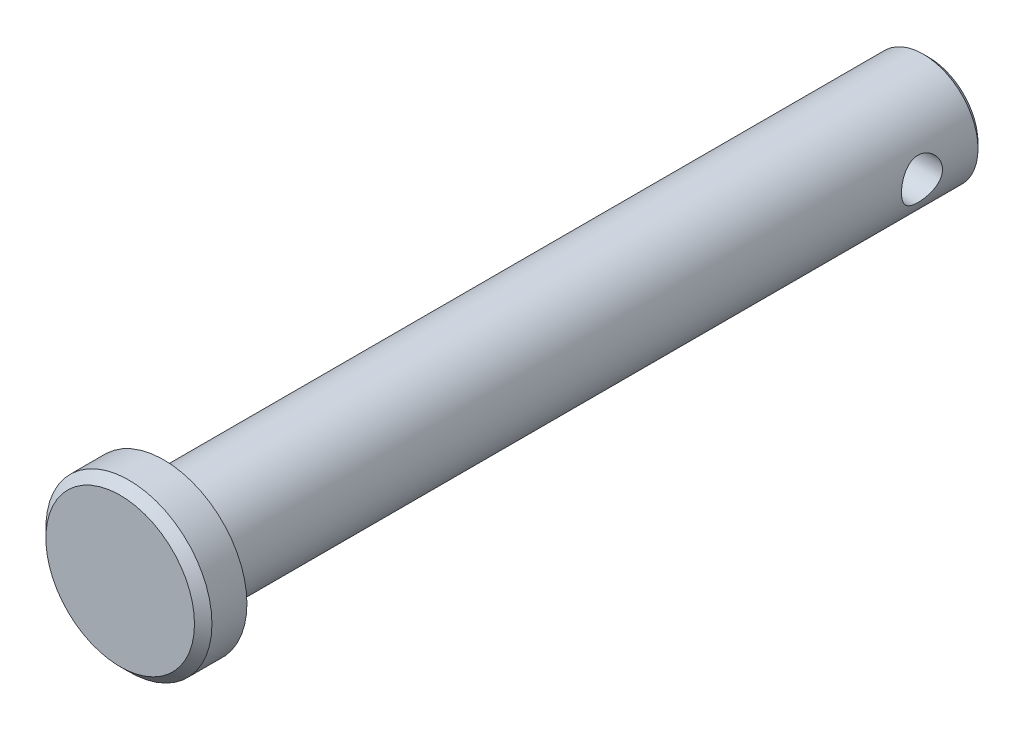
ISO-10303-21;
HEADER;
FILE_DESCRIPTION(('STEP AP214'),'2;1');
FILE_NAME('part.step','',(''),(''),'','','');
FILE_SCHEMA(('AUTOMOTIVE_DESIGN { 1 0 10303 214 1 1 1 1 }'));
ENDSEC;
DATA;
#1=APPLICATION_CONTEXT('core data for automotive mechanical design processes');
#2=APPLICATION_PROTOCOL_DEFINITION('international standard','automotive_design',2000,#1);
#3=PRODUCT_CONTEXT('',#1,'mechanical');
#4=PRODUCT('Part','Part','',(#3));
#5=PRODUCT_RELATED_PRODUCT_CATEGORY('part','',(#4));
#6=PRODUCT_DEFINITION_FORMATION('','',#4);
#7=PRODUCT_DEFINITION_CONTEXT('part definition',#1,'design');
#8=PRODUCT_DEFINITION('design','',#6,#7);
#9=PRODUCT_DEFINITION_SHAPE('','',#8);
#10=(LENGTH_UNIT() NAMED_UNIT(*) SI_UNIT(.MILLI.,.METRE.));
#11=(NAMED_UNIT(*) PLANE_ANGLE_UNIT() SI_UNIT($,.RADIAN.));
#12=(NAMED_UNIT(*) SI_UNIT($,.STERADIAN.) SOLID_ANGLE_UNIT());
#13=UNCERTAINTY_MEASURE_WITH_UNIT(LENGTH_MEASURE(1.E-05),#10,'distance_accuracy_value','');
#14=(GEOMETRIC_REPRESENTATION_CONTEXT(3) GLOBAL_UNCERTAINTY_ASSIGNED_CONTEXT((#13)) GLOBAL_UNIT_ASSIGNED_CONTEXT((#10,
#11,#12)) REPRESENTATION_CONTEXT('',''));
#15=CARTESIAN_POINT('',(0.,0.,0.));
#16=DIRECTION('',(0.,0.,1.));
#17=DIRECTION('',(1.,0.,0.));
#18=AXIS2_PLACEMENT_3D('',#15,#16,#17);
#19=CARTESIAN_POINT('',(0.,0.,22.225));
#20=DIRECTION('',(0.,0.,-1.));
#21=DIRECTION('',(-1.,0.,0.));
#22=AXIS2_PLACEMENT_3D('',#19,#20,#21);
#23=CYLINDRICAL_SURFACE('',#22,3.175);
#24=CARTESIAN_POINT('',(0.,0.,-21.9075));
#25=DIRECTION('',(0.,0.,1.));
#26=DIRECTION('',(1.,0.,0.));
#27=AXIS2_PLACEMENT_3D('',#24,#25,#26);
#28=CIRCLE('',#27,3.175);
#29=CARTESIAN_POINT('',(3.175,0.,-21.9075));
#30=VERTEX_POINT('',#29);
#31=EDGE_CURVE('E49',#30,#30,#28,.T.);
#32=ORIENTED_EDGE('',*,*,#31,.T.);
#33=EDGE_LOOP('',(#32));
#34=FACE_BOUND('',#33,.T.);
#35=CARTESIAN_POINT('',(-3.175,0.,-17.4625));
#36=CARTESIAN_POINT('',(-3.1750017260582,-0.0644803280319206,-17.4624976962969));
#37=CARTESIAN_POINT('',(-3.17301863556027,-0.128944879414297,-17.4677544346972));
#38=CARTESIAN_POINT('',(-3.16530589955499,-0.255947427804686,-17.4885573799955));
#39=CARTESIAN_POINT('',(-3.15957679372107,-0.31848570096517,-17.5041021047485));
#40=CARTESIAN_POINT('',(-3.14498698210789,-0.43978574808651,-17.5448539451563));
#41=CARTESIAN_POINT('',(-3.13613231952368,-0.498554552928809,-17.5700424227273));
#42=CARTESIAN_POINT('',(-3.11617334413749,-0.611028202439704,-17.6292719653313));
#43=CARTESIAN_POINT('',(-3.10506842811866,-0.664731683597445,-17.6633154047757));
#44=CARTESIAN_POINT('',(-3.08122833533403,-0.767831218530127,-17.7407986965375));
#45=CARTESIAN_POINT('',(-3.06844702050705,-0.816983642057511,-17.7845483956684));
#46=CARTESIAN_POINT('',(-3.04292175316615,-0.907450095452759,-17.8795445325105));
#47=CARTESIAN_POINT('',(-3.03017781325932,-0.948761726101174,-17.9307932563948));
#48=CARTESIAN_POINT('',(-3.00563336052824,-1.02392323008939,-18.0417132398466));
#49=CARTESIAN_POINT('',(-2.99388727501524,-1.05742893349134,-18.1016309659458));
#50=CARTESIAN_POINT('',(-2.97338639063463,-1.1137792552768,-18.2267608811213));
#51=CARTESIAN_POINT('',(-2.96463039737106,-1.13662813187984,-18.2919709432544));
#52=CARTESIAN_POINT('',(-2.95159440179158,-1.1700544212018,-18.42303016258));
#53=CARTESIAN_POINT('',(-2.94714552453477,-1.1810967711723,-18.4887433742581));
#54=CARTESIAN_POINT('',(-2.94273336284839,-1.19205022996996,-18.6212290754076));
#55=CARTESIAN_POINT('',(-2.94276822592073,-1.19196593587088,-18.6880011160129));
#56=CARTESIAN_POINT('',(-2.94717399857943,-1.18102403502952,-18.8164545606378));
#57=CARTESIAN_POINT('',(-2.95128528416453,-1.17081148004022,-18.8782014691726));
#58=CARTESIAN_POINT('',(-2.96294919584751,-1.14096933245487,-18.9990310506342));
#59=CARTESIAN_POINT('',(-2.97050234018472,-1.12133832170212,-19.0581133208748));
#60=CARTESIAN_POINT('',(-2.98835526113513,-1.07286225428949,-19.1732511725093));
#61=CARTESIAN_POINT('',(-2.99870429903107,-1.04384989935074,-19.2292283421088));
#62=CARTESIAN_POINT('',(-3.02096654298084,-0.977551335491416,-19.3357069292128));
#63=CARTESIAN_POINT('',(-3.03288028850368,-0.94026226991062,-19.3862064471563));
#64=CARTESIAN_POINT('',(-3.0579063084442,-0.855517884834484,-19.4838666580229));
#65=CARTESIAN_POINT('',(-3.07104532042938,-0.807547746065838,-19.5305748585938));
#66=CARTESIAN_POINT('',(-3.09635309230243,-0.704304368962601,-19.6154182606759));
#67=CARTESIAN_POINT('',(-3.10852170288599,-0.649030010276035,-19.6535521445933));
#68=CARTESIAN_POINT('',(-3.13075950879707,-0.531592978112735,-19.7206635026684));
#69=CARTESIAN_POINT('',(-3.1407933299357,-0.469337004114248,-19.7494902675942));
#70=CARTESIAN_POINT('',(-3.15736857672026,-0.340389250103891,-19.7961111921394));
#71=CARTESIAN_POINT('',(-3.1639115533356,-0.27369945485883,-19.8139102518954));
#72=CARTESIAN_POINT('',(-3.17249526812276,-0.141585349249255,-19.8371005876114));
#73=CARTESIAN_POINT('',(-3.17475686664138,-0.0762822480275054,-19.8431011938161));
#74=CARTESIAN_POINT('',(-3.17520553124475,0.0544294022336736,-19.8442985319706));
#75=CARTESIAN_POINT('',(-3.17339350069573,0.11983792468055,-19.8394976592515));
#76=CARTESIAN_POINT('',(-3.16604419632035,0.246270501045974,-19.8196914039175));
#77=CARTESIAN_POINT('',(-3.16065273826329,0.307366454105821,-19.8050852121587));
#78=CARTESIAN_POINT('',(-3.1468335994155,0.426197517997292,-19.7666085549156));
#79=CARTESIAN_POINT('',(-3.13840552373861,0.483932190588353,-19.7427368845038));
#80=CARTESIAN_POINT('',(-3.11903764373597,0.596302913556185,-19.6856457851262));
#81=CARTESIAN_POINT('',(-3.1080313141617,0.650798072574001,-19.652172302429));
#82=CARTESIAN_POINT('',(-3.08472420554452,0.753580464933011,-19.5771150056076));
#83=CARTESIAN_POINT('',(-3.07242294938803,0.801865395464672,-19.5355281972923));
#84=CARTESIAN_POINT('',(-3.04699455283473,0.893786946503483,-19.4425854780639));
#85=CARTESIAN_POINT('',(-3.03386090349835,0.936991348355828,-19.3908027674242));
#86=CARTESIAN_POINT('',(-3.00893809999065,1.01418270962823,-19.2804642133883));
#87=CARTESIAN_POINT('',(-2.99714906660554,1.04816884135274,-19.2219077624604));
#88=CARTESIAN_POINT('',(-2.9762992117158,1.10599357730705,-19.0991998104995));
#89=CARTESIAN_POINT('',(-2.96724991010741,1.12978950323492,-19.0350261079336));
#90=CARTESIAN_POINT('',(-2.95317888607235,1.16608132501843,-18.9031485000728));
#91=CARTESIAN_POINT('',(-2.94815467214383,1.17858421180019,-18.8354468062678));
#92=CARTESIAN_POINT('',(-2.94303366491605,1.1913103800891,-18.7031184233643));
#93=CARTESIAN_POINT('',(-2.94264115340402,1.19227069374821,-18.6385734735747));
#94=CARTESIAN_POINT('',(-2.94606990116576,1.18377268040514,-18.5102934052058));
#95=CARTESIAN_POINT('',(-2.94989076088501,1.17431534131036,-18.4465582104169));
#96=CARTESIAN_POINT('',(-2.96106962383437,1.14582428656504,-18.3236812637937));
#97=CARTESIAN_POINT('',(-2.96831611517726,1.12709164913741,-18.2644586876678));
#98=CARTESIAN_POINT('',(-2.98546478961414,1.08084696819062,-18.1499625026326));
#99=CARTESIAN_POINT('',(-2.99536764396202,1.0533327052505,-18.0946898963443));
#100=CARTESIAN_POINT('',(-3.01735905848773,0.988632102759102,-17.9865124856775));
#101=CARTESIAN_POINT('',(-3.02953498137515,0.9510143603739,-17.9338836800401));
#102=CARTESIAN_POINT('',(-3.05439958363509,0.867842480481136,-17.8354501359791));
#103=CARTESIAN_POINT('',(-3.06708842498621,0.822285820601671,-17.789647575013));
#104=CARTESIAN_POINT('',(-3.09237399534093,0.721582564947798,-17.7036396975664));
#105=CARTESIAN_POINT('',(-3.10492858264887,0.666050423844066,-17.6638713957112));
#106=CARTESIAN_POINT('',(-3.12780770850268,0.548650495915654,-17.5942445173742));
#107=CARTESIAN_POINT('',(-3.13813207344674,0.486782216434433,-17.5643867122343));
#108=CARTESIAN_POINT('',(-3.15574594756552,0.355599271339336,-17.5145883919429));
#109=CARTESIAN_POINT('',(-3.16288465369445,0.286078153898403,-17.4951333924723));
#110=CARTESIAN_POINT('',(-3.17250954730047,0.144363863550066,-17.469093713063));
#111=CARTESIAN_POINT('',(-3.17499806804399,0.072172049239607,-17.4625025785069));
#112=CARTESIAN_POINT('',(-3.175,0.,-17.4625));
#113=B_SPLINE_CURVE_WITH_KNOTS('',3,(#35,#36,#37,#38,#39,#40,#41,#42,#43,#44,#45,#46,#47,#48,
#49,#50,#51,#52,#53,#54,#55,#56,#57,#58,#59,#60,#61,#62,#63,#64,#65,#66,#67,#68,#69,#70,#71,#72,
#73,#74,#75,#76,#77,#78,#79,#80,#81,#82,#83,#84,#85,#86,#87,#88,#89,#90,#91,#92,#93,#94,#95,#96,
#97,#98,#99,#100,#101,#102,#103,#104,#105,#106,#107,#108,#109,#110,#111,#112),.UNSPECIFIED.,.T.,
.F.,(4,2,2,2,2,2,2,2,2,2,2,2,2,2,2,2,2,2,2,2,2,2,2,2,2,2,2,2,2,2,2,2,2,2,2,2,2,2,4),(0.,
0.193174779988694,0.386321736189803,0.579097274313275,0.771924557565036,0.972134347500308,
1.17240530159713,1.38030485385692,1.58812126298257,1.78741287818416,1.98662215450768,
2.17390936438977,2.36122478335593,2.55208411657196,2.74300942653256,2.94676634210302,
3.15055454712147,3.35749404133323,3.56434151635959,3.76019234336016,3.95599974284976,
4.14428335102049,4.33259145270723,4.52643257351058,4.72034536640771,4.92550862317929,
5.13069029517863,5.33672309214719,5.54262825746728,5.73531018512451,5.92797384230188,
6.11475744301062,6.30158828783603,6.4982127455814,6.69489978960168,6.90223036662894,
7.10957707657801,7.32590383806685,7.54212202675677),.UNSPECIFIED.);
#114=CARTESIAN_POINT('',(-3.175,0.,-17.4625));
#115=VERTEX_POINT('',#114);
#116=EDGE_CURVE('E60',#115,#115,#113,.T.);
#117=ORIENTED_EDGE('',*,*,#116,.T.);
#118=EDGE_LOOP('',(#117));
#119=FACE_BOUND('',#118,.T.);
#120=CARTESIAN_POINT('',(3.175,0.,-19.84375));
#121=CARTESIAN_POINT('',(3.1750017260582,-0.0644803280319213,-19.8437523037031));
#122=CARTESIAN_POINT('',(3.17301863556027,-0.128944879414299,-19.8384955653029));
#123=CARTESIAN_POINT('',(3.16530589955499,-0.255947427804687,-19.8176926200045));
#124=CARTESIAN_POINT('',(3.15957679372107,-0.318485700965169,-19.8021478952515));
#125=CARTESIAN_POINT('',(3.14498698210789,-0.439785748086511,-19.7613960548437));
#126=CARTESIAN_POINT('',(3.13613231952368,-0.498554552928811,-19.7362075772727));
#127=CARTESIAN_POINT('',(3.11617334413749,-0.611028202439704,-19.6769780346687));
#128=CARTESIAN_POINT('',(3.10506842811866,-0.664731683597441,-19.6429345952243));
#129=CARTESIAN_POINT('',(3.08122833533403,-0.767831218530124,-19.5654513034625));
#130=CARTESIAN_POINT('',(3.06844702050705,-0.816983642057513,-19.5217016043316));
#131=CARTESIAN_POINT('',(3.04292175316615,-0.907450095452761,-19.4267054674896));
#132=CARTESIAN_POINT('',(3.03017781325932,-0.948761726101171,-19.3754567436053));
#133=CARTESIAN_POINT('',(3.00563336052824,-1.02392323008938,-19.2645367601535));
#134=CARTESIAN_POINT('',(2.99388727501524,-1.05742893349135,-19.2046190340543));
#135=CARTESIAN_POINT('',(2.97338639063463,-1.1137792552768,-19.0794891188787));
#136=CARTESIAN_POINT('',(2.96463039737106,-1.13662813187984,-19.0142790567456));
#137=CARTESIAN_POINT('',(2.95159440179158,-1.1700544212018,-18.8832198374201));
#138=CARTESIAN_POINT('',(2.94714552453477,-1.18109677117231,-18.8175066257419));
#139=CARTESIAN_POINT('',(2.94273336284839,-1.19205022996996,-18.6850209245924));
#140=CARTESIAN_POINT('',(2.94276822592073,-1.19196593587088,-18.6182488839871));
#141=CARTESIAN_POINT('',(2.94717399857943,-1.18102403502952,-18.4897954393622));
#142=CARTESIAN_POINT('',(2.95128528416453,-1.17081148004022,-18.4280485308274));
#143=CARTESIAN_POINT('',(2.96294919584751,-1.14096933245487,-18.3072189493658));
#144=CARTESIAN_POINT('',(2.97050234018472,-1.12133832170212,-18.2481366791252));
#145=CARTESIAN_POINT('',(2.98835526113513,-1.07286225428949,-18.1329988274907));
#146=CARTESIAN_POINT('',(2.99870429903106,-1.04384989935074,-18.0770216578912));
#147=CARTESIAN_POINT('',(3.02096654298085,-0.977551335491412,-17.9705430707872));
#148=CARTESIAN_POINT('',(3.03288028850369,-0.940262269910617,-17.9200435528437));
#149=CARTESIAN_POINT('',(3.05790630844422,-0.855517884834481,-17.8223833419771));
#150=CARTESIAN_POINT('',(3.07104532042939,-0.807547746065831,-17.7756751414062));
#151=CARTESIAN_POINT('',(3.09635309230243,-0.704304368962594,-17.6908317393241));
#152=CARTESIAN_POINT('',(3.10852170288599,-0.649030010276033,-17.6526978554067));
#153=CARTESIAN_POINT('',(3.13075950879707,-0.531592978112735,-17.5855864973316));
#154=CARTESIAN_POINT('',(3.1407933299357,-0.469337004114246,-17.5567597324058));
#155=CARTESIAN_POINT('',(3.15736857672026,-0.340389250103887,-17.5101388078607));
#156=CARTESIAN_POINT('',(3.1639115533356,-0.273699454858829,-17.4923397481046));
#157=CARTESIAN_POINT('',(3.17249526812276,-0.141585349249255,-17.4691494123886));
#158=CARTESIAN_POINT('',(3.17475686664138,-0.0762822480275046,-17.4631488061839));
#159=CARTESIAN_POINT('',(3.17520553124475,0.0544294022336764,-17.4619514680294));
#160=CARTESIAN_POINT('',(3.17339350069573,0.119837924680554,-17.4667523407486));
#161=CARTESIAN_POINT('',(3.16604419632035,0.246270501045976,-17.4865585960825));
#162=CARTESIAN_POINT('',(3.16065273826329,0.307366454105821,-17.5011647878413));
#163=CARTESIAN_POINT('',(3.1468335994155,0.426197517997293,-17.5396414450844));
#164=CARTESIAN_POINT('',(3.13840552373861,0.483932190588358,-17.5635131154963));
#165=CARTESIAN_POINT('',(3.11903764373597,0.596302913556188,-17.6206042148738));
#166=CARTESIAN_POINT('',(3.1080313141617,0.650798072573999,-17.6540776975711));
#167=CARTESIAN_POINT('',(3.08472420554452,0.753580464933008,-17.7291349943924));
#168=CARTESIAN_POINT('',(3.07242294938803,0.801865395464673,-17.7707218027077));
#169=CARTESIAN_POINT('',(3.04699455283473,0.893786946503483,-17.8636645219361));
#170=CARTESIAN_POINT('',(3.03386090349835,0.936991348355824,-17.9154472325758));
#171=CARTESIAN_POINT('',(3.00893809999065,1.01418270962823,-18.0257857866117));
#172=CARTESIAN_POINT('',(2.99714906660554,1.04816884135274,-18.0843422375396));
#173=CARTESIAN_POINT('',(2.9762992117158,1.10599357730705,-18.2070501895005));
#174=CARTESIAN_POINT('',(2.96724991010742,1.12978950323491,-18.2712238920664));
#175=CARTESIAN_POINT('',(2.95317888607235,1.16608132501843,-18.4031014999272));
#176=CARTESIAN_POINT('',(2.94815467214383,1.17858421180019,-18.4708031937323));
#177=CARTESIAN_POINT('',(2.94303366491605,1.1913103800891,-18.6031315766358));
#178=CARTESIAN_POINT('',(2.94264115340402,1.19227069374821,-18.6676765264253));
#179=CARTESIAN_POINT('',(2.94606990116576,1.18377268040514,-18.7959565947942));
#180=CARTESIAN_POINT('',(2.94989076088501,1.17431534131036,-18.8596917895831));
#181=CARTESIAN_POINT('',(2.96106962383437,1.14582428656505,-18.9825687362063));
#182=CARTESIAN_POINT('',(2.96831611517726,1.12709164913742,-19.0417913123322));
#183=CARTESIAN_POINT('',(2.98546478961414,1.08084696819062,-19.1562874973674));
#184=CARTESIAN_POINT('',(2.99536764396201,1.0533327052505,-19.2115601036557));
#185=CARTESIAN_POINT('',(3.01735905848771,0.988632102759101,-19.3197375143225));
#186=CARTESIAN_POINT('',(3.02953498137515,0.951014360373903,-19.3723663199599));
#187=CARTESIAN_POINT('',(3.05439958363509,0.867842480481139,-19.4707998640209));
#188=CARTESIAN_POINT('',(3.06708842498621,0.822285820601671,-19.516602424987));
#189=CARTESIAN_POINT('',(3.09237399534093,0.721582564947798,-19.6026103024336));
#190=CARTESIAN_POINT('',(3.10492858264887,0.666050423844069,-19.6423786042888));
#191=CARTESIAN_POINT('',(3.12780770850268,0.548650495915657,-19.7120054826258));
#192=CARTESIAN_POINT('',(3.13813207344674,0.486782216434433,-19.7418632877657));
#193=CARTESIAN_POINT('',(3.15574594756552,0.355599271339335,-19.7916616080571));
#194=CARTESIAN_POINT('',(3.16288465369445,0.286078153898405,-19.8111166075278));
#195=CARTESIAN_POINT('',(3.17250954730047,0.144363863550068,-19.8371562869371));
#196=CARTESIAN_POINT('',(3.17499806804399,0.072172049239608,-19.8437474214931));
#197=CARTESIAN_POINT('',(3.175,0.,-19.84375));
#198=B_SPLINE_CURVE_WITH_KNOTS('',3,(#120,#121,#122,#123,#124,#125,#126,#127,#128,#129,#130,
#131,#132,#133,#134,#135,#136,#137,#138,#139,#140,#141,#142,#143,#144,#145,#146,#147,#148,#149,
#150,#151,#152,#153,#154,#155,#156,#157,#158,#159,#160,#161,#162,#163,#164,#165,#166,#167,#168,
#169,#170,#171,#172,#173,#174,#175,#176,#177,#178,#179,#180,#181,#182,#183,#184,#185,#186,#187,
#188,#189,#190,#191,#192,#193,#194,#195,#196,#197),.UNSPECIFIED.,.T.,.F.,(4,2,2,2,2,2,2,2,2,2,2,
2,2,2,2,2,2,2,2,2,2,2,2,2,2,2,2,2,2,2,2,2,2,2,2,2,2,2,4),(0.,0.193174779988694,
0.386321736189804,0.579097274313276,0.771924557565035,0.972134347500306,1.17240530159713,
1.38030485385692,1.58812126298257,1.78741287818416,1.98662215450769,2.17390936438978,
2.36122478335593,2.55208411657197,2.74300942653256,2.94676634210302,3.15055454712147,
3.35749404133323,3.56434151635959,3.76019234336016,3.95599974284977,4.14428335102049,
4.33259145270723,4.52643257351058,4.72034536640771,4.92550862317929,5.13069029517863,
5.33672309214719,5.54262825746728,5.73531018512451,5.92797384230187,6.11475744301061,
6.30158828783602,6.4982127455814,6.69489978960168,6.90223036662895,7.10957707657801,
7.32590383806685,7.54212202675678),.UNSPECIFIED.);
#199=CARTESIAN_POINT('',(3.175,0.,-19.84375));
#200=VERTEX_POINT('',#199);
#201=EDGE_CURVE('E69',#200,#200,#198,.T.);
#202=ORIENTED_EDGE('',*,*,#201,.T.);
#203=EDGE_LOOP('',(#202));
#204=FACE_BOUND('',#203,.T.);
#205=CARTESIAN_POINT('',(0.,0.,22.225));
#206=DIRECTION('',(0.,0.,1.));
#207=DIRECTION('',(1.,0.,0.));
#208=AXIS2_PLACEMENT_3D('',#205,#206,#207);
#209=CIRCLE('',#208,3.175);
#210=CARTESIAN_POINT('',(3.175,0.,22.225));
#211=VERTEX_POINT('',#210);
#212=EDGE_CURVE('E108',#211,#211,#209,.T.);
#213=ORIENTED_EDGE('',*,*,#212,.F.);
#214=EDGE_LOOP('',(#213));
#215=FACE_BOUND('',#214,.T.);
#216=ADVANCED_FACE('F42',(#34,#119,#204,#215),#23,.T.);
#217=CARTESIAN_POINT('',(0.,0.,-22.225));
#218=DIRECTION('',(0.,0.,1.));
#219=DIRECTION('',(1.,0.,0.));
#220=AXIS2_PLACEMENT_3D('',#217,#218,#219);
#221=PLANE('',#220);
#222=CARTESIAN_POINT('',(0.,0.,-22.225));
#223=DIRECTION('',(0.,0.,1.));
#224=DIRECTION('',(1.,0.,0.));
#225=AXIS2_PLACEMENT_3D('',#222,#223,#224);
#226=CIRCLE('',#225,2.85750000000001);
#227=CARTESIAN_POINT('',(2.85750000000001,0.,-22.225));
#228=VERTEX_POINT('',#227);
#229=EDGE_CURVE('E12',#228,#228,#226,.F.);
#230=ORIENTED_EDGE('',*,*,#229,.T.);
#231=EDGE_LOOP('',(#230));
#232=FACE_BOUND('',#231,.T.);
#233=ADVANCED_FACE('F90',(#232),#221,.F.);
#234=CARTESIAN_POINT('',(0.,0.,22.225));
#235=DIRECTION('',(0.,0.,1.));
#236=DIRECTION('',(1.,0.,0.));
#237=AXIS2_PLACEMENT_3D('',#234,#235,#236);
#238=PLANE('',#237);
#239=CARTESIAN_POINT('',(0.,0.,22.225));
#240=DIRECTION('',(0.,0.,1.));
#241=DIRECTION('',(1.,0.,0.));
#242=AXIS2_PLACEMENT_3D('',#239,#240,#241);
#243=CIRCLE('',#242,4.826);
#244=CARTESIAN_POINT('',(4.826,0.,22.225));
#245=VERTEX_POINT('',#244);
#246=EDGE_CURVE('E68',#245,#245,#243,.T.);
#247=ORIENTED_EDGE('',*,*,#246,.F.);
#248=EDGE_LOOP('',(#247));
#249=FACE_BOUND('',#248,.T.);
#250=ORIENTED_EDGE('',*,*,#212,.T.);
#251=EDGE_LOOP('',(#250));
#252=FACE_BOUND('',#251,.T.);
#253=ADVANCED_FACE('F87',(#249,#252),#238,.F.);
#254=CARTESIAN_POINT('',(0.,0.,24.765));
#255=DIRECTION('',(0.,0.,-1.));
#256=DIRECTION('',(-1.,0.,0.));
#257=AXIS2_PLACEMENT_3D('',#254,#255,#256);
#258=CYLINDRICAL_SURFACE('',#257,4.826);
#259=CARTESIAN_POINT('',(0.,0.,24.257));
#260=DIRECTION('',(0.,0.,1.));
#261=DIRECTION('',(1.,0.,0.));
#262=AXIS2_PLACEMENT_3D('',#259,#260,#261);
#263=CIRCLE('',#262,4.826);
#264=CARTESIAN_POINT('',(4.826,0.,24.257));
#265=VERTEX_POINT('',#264);
#266=EDGE_CURVE('E53',#265,#265,#263,.F.);
#267=ORIENTED_EDGE('',*,*,#266,.T.);
#268=EDGE_LOOP('',(#267));
#269=FACE_BOUND('',#268,.T.);
#270=ORIENTED_EDGE('',*,*,#246,.T.);
#271=EDGE_LOOP('',(#270));
#272=FACE_BOUND('',#271,.T.);
#273=ADVANCED_FACE('F85',(#269,#272),#258,.T.);
#274=CARTESIAN_POINT('',(0.,0.,24.765));
#275=DIRECTION('',(0.,0.,1.));
#276=DIRECTION('',(1.,0.,0.));
#277=AXIS2_PLACEMENT_3D('',#274,#275,#276);
#278=PLANE('',#277);
#279=CARTESIAN_POINT('',(0.,0.,24.765));
#280=DIRECTION('',(0.,0.,1.));
#281=DIRECTION('',(1.,0.,0.));
#282=AXIS2_PLACEMENT_3D('',#279,#280,#281);
#283=CIRCLE('',#282,4.31799999999999);
#284=CARTESIAN_POINT('',(4.31799999999999,0.,24.765));
#285=VERTEX_POINT('',#284);
#286=EDGE_CURVE('E57',#285,#285,#283,.T.);
#287=ORIENTED_EDGE('',*,*,#286,.T.);
#288=EDGE_LOOP('',(#287));
#289=FACE_BOUND('',#288,.T.);
#290=ADVANCED_FACE('F81',(#289),#278,.T.);
#291=CARTESIAN_POINT('',(0.,0.,24.765));
#292=DIRECTION('',(0.,0.,-1.));
#293=DIRECTION('',(-1.,0.,0.));
#294=AXIS2_PLACEMENT_3D('',#291,#292,#293);
#295=CONICAL_SURFACE('',#294,4.31799999999999,0.785398163397447);
#296=ORIENTED_EDGE('',*,*,#266,.F.);
#297=EDGE_LOOP('',(#296));
#298=FACE_BOUND('',#297,.T.);
#299=ORIENTED_EDGE('',*,*,#286,.F.);
#300=EDGE_LOOP('',(#299));
#301=FACE_BOUND('',#300,.T.);
#302=ADVANCED_FACE('F79',(#298,#301),#295,.T.);
#303=CARTESIAN_POINT('',(-4.826,0.,-18.653125));
#304=DIRECTION('',(1.,0.,0.));
#305=DIRECTION('',(0.,0.,-1.));
#306=AXIS2_PLACEMENT_3D('',#303,#304,#305);
#307=CYLINDRICAL_SURFACE('',#306,1.190625);
#308=ORIENTED_EDGE('',*,*,#201,.F.);
#309=EDGE_LOOP('',(#308));
#310=FACE_BOUND('',#309,.T.);
#311=ORIENTED_EDGE('',*,*,#116,.F.);
#312=EDGE_LOOP('',(#311));
#313=FACE_BOUND('',#312,.T.);
#314=ADVANCED_FACE('F75',(#310,#313),#307,.F.);
#315=CARTESIAN_POINT('',(0.,0.,-21.9075));
#316=DIRECTION('',(0.,0.,1.));
#317=DIRECTION('',(1.,0.,0.));
#318=AXIS2_PLACEMENT_3D('',#315,#316,#317);
#319=CONICAL_SURFACE('',#318,3.175,0.785398163397442);
#320=ORIENTED_EDGE('',*,*,#229,.F.);
#321=EDGE_LOOP('',(#320));
#322=FACE_BOUND('',#321,.T.);
#323=ORIENTED_EDGE('',*,*,#31,.F.);
#324=EDGE_LOOP('',(#323));
#325=FACE_BOUND('',#324,.T.);
#326=ADVANCED_FACE('F44',(#322,#325),#319,.T.);
#327=CLOSED_SHELL('',(#216,#233,#253,#273,#290,#302,#314,#326));
#328=MANIFOLD_SOLID_BREP('B2',#327);
#329=ADVANCED_BREP_SHAPE_REPRESENTATION('',(#18,#328),#14);
#330=SHAPE_DEFINITION_REPRESENTATION(#9,#329);
ENDSEC;
END-ISO-10303-21;
